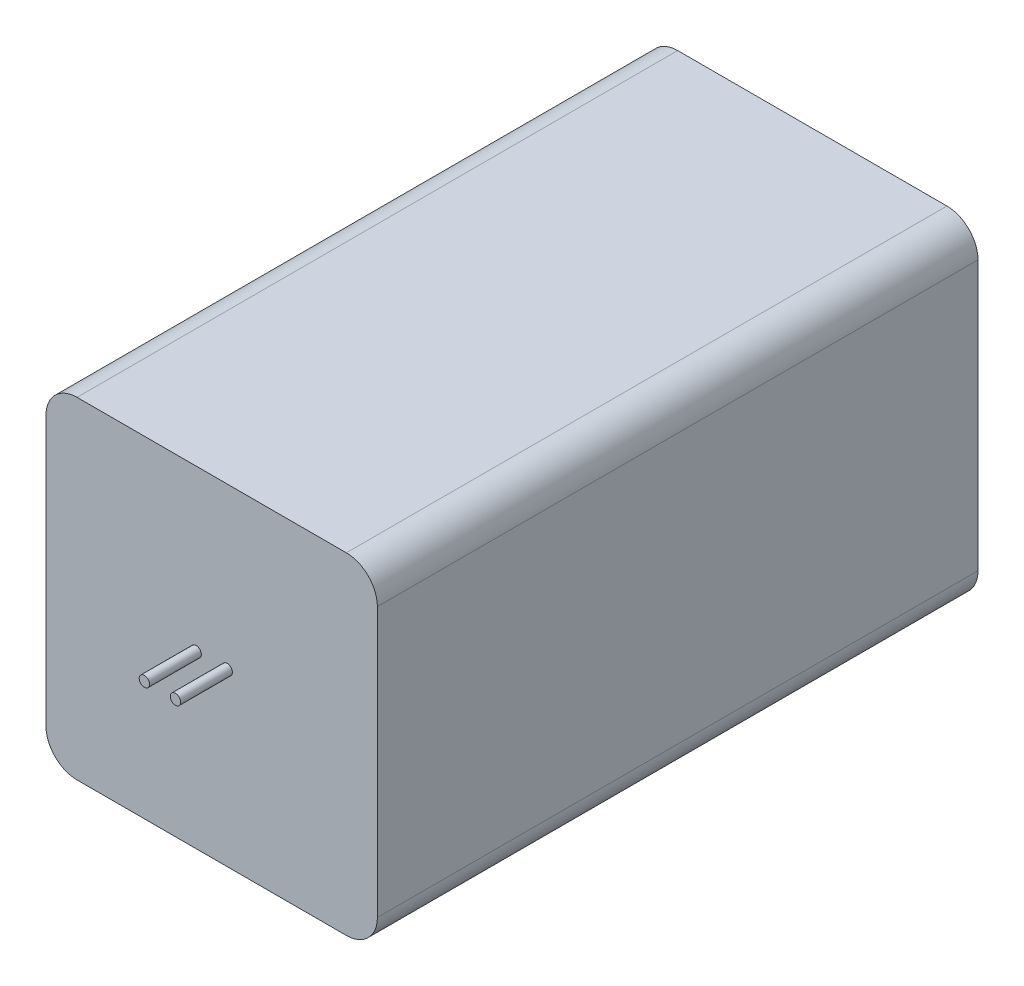
ISO-10303-21;
HEADER;
FILE_DESCRIPTION(('STEP AP214'),'2;1');
FILE_NAME('part.step','',(''),(''),'','','');
FILE_SCHEMA(('AUTOMOTIVE_DESIGN { 1 0 10303 214 1 1 1 1 }'));
ENDSEC;
DATA;
#1=APPLICATION_CONTEXT('core data for automotive mechanical design processes');
#2=APPLICATION_PROTOCOL_DEFINITION('international standard','automotive_design',2000,#1);
#3=PRODUCT_CONTEXT('',#1,'mechanical');
#4=PRODUCT('Part','Part','',(#3));
#5=PRODUCT_RELATED_PRODUCT_CATEGORY('part','',(#4));
#6=PRODUCT_DEFINITION_FORMATION('','',#4);
#7=PRODUCT_DEFINITION_CONTEXT('part definition',#1,'design');
#8=PRODUCT_DEFINITION('design','',#6,#7);
#9=PRODUCT_DEFINITION_SHAPE('','',#8);
#10=(LENGTH_UNIT() NAMED_UNIT(*) SI_UNIT(.MILLI.,.METRE.));
#11=(NAMED_UNIT(*) PLANE_ANGLE_UNIT() SI_UNIT($,.RADIAN.));
#12=(NAMED_UNIT(*) SI_UNIT($,.STERADIAN.) SOLID_ANGLE_UNIT());
#13=UNCERTAINTY_MEASURE_WITH_UNIT(LENGTH_MEASURE(1.E-05),#10,'distance_accuracy_value','');
#14=(GEOMETRIC_REPRESENTATION_CONTEXT(3) GLOBAL_UNCERTAINTY_ASSIGNED_CONTEXT((#13)) GLOBAL_UNIT_ASSIGNED_CONTEXT((#10,
#11,#12)) REPRESENTATION_CONTEXT('',''));
#15=CARTESIAN_POINT('',(0.,0.,0.));
#16=DIRECTION('',(0.,0.,1.));
#17=DIRECTION('',(1.,0.,0.));
#18=AXIS2_PLACEMENT_3D('',#15,#16,#17);
#19=CARTESIAN_POINT('',(1.5,0.5,63.));
#20=DIRECTION('',(0.,0.,-1.));
#21=DIRECTION('',(-1.,0.,0.));
#22=AXIS2_PLACEMENT_3D('',#19,#20,#21);
#23=CYLINDRICAL_SURFACE('',#22,0.500000000000001);
#24=CARTESIAN_POINT('',(1.5,0.5,63.));
#25=DIRECTION('',(0.,0.,1.));
#26=DIRECTION('',(1.,0.,0.));
#27=AXIS2_PLACEMENT_3D('',#24,#25,#26);
#28=CIRCLE('',#27,0.500000000000001);
#29=CARTESIAN_POINT('',(2.,0.5,63.));
#30=VERTEX_POINT('',#29);
#31=EDGE_CURVE('E58',#30,#30,#28,.T.);
#32=ORIENTED_EDGE('',*,*,#31,.F.);
#33=EDGE_LOOP('',(#32));
#34=FACE_BOUND('',#33,.T.);
#35=CARTESIAN_POINT('',(1.5,0.5,58.));
#36=DIRECTION('',(0.,0.,1.));
#37=DIRECTION('',(1.,0.,0.));
#38=AXIS2_PLACEMENT_3D('',#35,#36,#37);
#39=CIRCLE('',#38,0.500000000000001);
#40=CARTESIAN_POINT('',(2.,0.5,58.));
#41=VERTEX_POINT('',#40);
#42=EDGE_CURVE('E11',#41,#41,#39,.T.);
#43=ORIENTED_EDGE('',*,*,#42,.T.);
#44=EDGE_LOOP('',(#43));
#45=FACE_BOUND('',#44,.T.);
#46=ADVANCED_FACE('F54',(#34,#45),#23,.T.);
#47=CARTESIAN_POINT('',(1.5,0.5,63.));
#48=DIRECTION('',(0.,0.,1.));
#49=DIRECTION('',(1.,0.,0.));
#50=AXIS2_PLACEMENT_3D('',#47,#48,#49);
#51=PLANE('',#50);
#52=ORIENTED_EDGE('',*,*,#31,.T.);
#53=EDGE_LOOP('',(#52));
#54=FACE_BOUND('',#53,.T.);
#55=ADVANCED_FACE('F56',(#54),#51,.T.);
#56=CARTESIAN_POINT('',(1.5,0.5,58.));
#57=DIRECTION('',(0.,0.,1.));
#58=DIRECTION('',(1.,0.,0.));
#59=AXIS2_PLACEMENT_3D('',#56,#57,#58);
#60=PLANE('',#59);
#61=ORIENTED_EDGE('',*,*,#42,.F.);
#62=EDGE_LOOP('',(#61));
#63=FACE_BOUND('',#62,.T.);
#64=ADVANCED_FACE('F73',(#63),#60,.F.);
#65=CLOSED_SHELL('',(#46,#55,#64));
#66=MANIFOLD_SOLID_BREP('B2',#65);
#67=CARTESIAN_POINT('',(-1.5,0.5,63.));
#68=DIRECTION('',(0.,0.,-1.));
#69=DIRECTION('',(-1.,0.,0.));
#70=AXIS2_PLACEMENT_3D('',#67,#68,#69);
#71=CYLINDRICAL_SURFACE('',#70,0.500000000000001);
#72=CARTESIAN_POINT('',(-1.5,0.5,63.));
#73=DIRECTION('',(0.,0.,1.));
#74=DIRECTION('',(1.,0.,0.));
#75=AXIS2_PLACEMENT_3D('',#72,#73,#74);
#76=CIRCLE('',#75,0.500000000000001);
#77=CARTESIAN_POINT('',(-0.999999999999999,0.5,63.));
#78=VERTEX_POINT('',#77);
#79=EDGE_CURVE('E53',#78,#78,#76,.T.);
#80=ORIENTED_EDGE('',*,*,#79,.F.);
#81=EDGE_LOOP('',(#80));
#82=FACE_BOUND('',#81,.T.);
#83=CARTESIAN_POINT('',(-1.5,0.5,58.));
#84=DIRECTION('',(0.,0.,1.));
#85=DIRECTION('',(1.,0.,0.));
#86=AXIS2_PLACEMENT_3D('',#83,#84,#85);
#87=CIRCLE('',#86,0.500000000000001);
#88=CARTESIAN_POINT('',(-0.999999999999999,0.5,58.));
#89=VERTEX_POINT('',#88);
#90=EDGE_CURVE('E119',#89,#89,#87,.T.);
#91=ORIENTED_EDGE('',*,*,#90,.T.);
#92=EDGE_LOOP('',(#91));
#93=FACE_BOUND('',#92,.T.);
#94=ADVANCED_FACE('F116',(#82,#93),#71,.T.);
#95=CARTESIAN_POINT('',(-1.5,0.5,63.));
#96=DIRECTION('',(0.,0.,1.));
#97=DIRECTION('',(1.,0.,0.));
#98=AXIS2_PLACEMENT_3D('',#95,#96,#97);
#99=PLANE('',#98);
#100=ORIENTED_EDGE('',*,*,#79,.T.);
#101=EDGE_LOOP('',(#100));
#102=FACE_BOUND('',#101,.T.);
#103=ADVANCED_FACE('F131',(#102),#99,.T.);
#104=CARTESIAN_POINT('',(-1.5,0.5,58.));
#105=DIRECTION('',(0.,0.,1.));
#106=DIRECTION('',(1.,0.,0.));
#107=AXIS2_PLACEMENT_3D('',#104,#105,#106);
#108=PLANE('',#107);
#109=ORIENTED_EDGE('',*,*,#90,.F.);
#110=EDGE_LOOP('',(#109));
#111=FACE_BOUND('',#110,.T.);
#112=ADVANCED_FACE('F129',(#111),#108,.F.);
#113=CLOSED_SHELL('',(#94,#103,#112));
#114=MANIFOLD_SOLID_BREP('B6',#113);
#115=CARTESIAN_POINT('',(-16.,16.,58.));
#116=DIRECTION('',(1.,0.,0.));
#117=DIRECTION('',(0.,1.,0.));
#118=AXIS2_PLACEMENT_3D('',#115,#116,#117);
#119=PLANE('',#118);
#120=DIRECTION('',(0.,-1.,0.));
#121=VECTOR('',#120,1.);
#122=CARTESIAN_POINT('',(-16.,16.,0.));
#123=LINE('',#122,#121);
#124=CARTESIAN_POINT('',(-16.,13.,0.));
#125=VERTEX_POINT('',#124);
#126=CARTESIAN_POINT('',(-16.,-13.,0.));
#127=VERTEX_POINT('',#126);
#128=EDGE_CURVE('E270',#125,#127,#123,.T.);
#129=ORIENTED_EDGE('',*,*,#128,.T.);
#130=DIRECTION('',(0.,0.,-1.));
#131=VECTOR('',#130,1.);
#132=CARTESIAN_POINT('',(-16.,-13.,58.));
#133=LINE('',#132,#131);
#134=CARTESIAN_POINT('',(-16.,-13.,58.));
#135=VERTEX_POINT('',#134);
#136=EDGE_CURVE('E304',#127,#135,#133,.F.);
#137=ORIENTED_EDGE('',*,*,#136,.T.);
#138=DIRECTION('',(0.,-1.,0.));
#139=VECTOR('',#138,1.);
#140=CARTESIAN_POINT('',(-16.,16.,58.));
#141=LINE('',#140,#139);
#142=CARTESIAN_POINT('',(-16.,13.,58.));
#143=VERTEX_POINT('',#142);
#144=EDGE_CURVE('E268',#143,#135,#141,.T.);
#145=ORIENTED_EDGE('',*,*,#144,.F.);
#146=DIRECTION('',(0.,0.,-1.));
#147=VECTOR('',#146,1.);
#148=CARTESIAN_POINT('',(-16.,13.,58.));
#149=LINE('',#148,#147);
#150=EDGE_CURVE('E300',#143,#125,#149,.T.);
#151=ORIENTED_EDGE('',*,*,#150,.T.);
#152=EDGE_LOOP('',(#129,#137,#145,#151));
#153=FACE_BOUND('',#152,.T.);
#154=ADVANCED_FACE('F169',(#153),#119,.F.);
#155=CARTESIAN_POINT('',(16.,-16.,58.));
#156=DIRECTION('',(0.,1.,0.));
#157=DIRECTION('',(-1.,0.,0.));
#158=AXIS2_PLACEMENT_3D('',#155,#156,#157);
#159=PLANE('',#158);
#160=DIRECTION('',(1.,0.,0.));
#161=VECTOR('',#160,1.);
#162=CARTESIAN_POINT('',(16.,-16.,0.));
#163=LINE('',#162,#161);
#164=CARTESIAN_POINT('',(-13.,-16.,0.));
#165=VERTEX_POINT('',#164);
#166=CARTESIAN_POINT('',(13.,-16.,0.));
#167=VERTEX_POINT('',#166);
#168=EDGE_CURVE('E264',#165,#167,#163,.T.);
#169=ORIENTED_EDGE('',*,*,#168,.T.);
#170=DIRECTION('',(0.,0.,-1.));
#171=VECTOR('',#170,1.);
#172=CARTESIAN_POINT('',(13.,-16.,58.));
#173=LINE('',#172,#171);
#174=CARTESIAN_POINT('',(13.,-16.,58.));
#175=VERTEX_POINT('',#174);
#176=EDGE_CURVE('E240',#167,#175,#173,.F.);
#177=ORIENTED_EDGE('',*,*,#176,.T.);
#178=DIRECTION('',(1.,0.,0.));
#179=VECTOR('',#178,1.);
#180=CARTESIAN_POINT('',(16.,-16.,58.));
#181=LINE('',#180,#179);
#182=CARTESIAN_POINT('',(-13.,-16.,58.));
#183=VERTEX_POINT('',#182);
#184=EDGE_CURVE('E323',#183,#175,#181,.T.);
#185=ORIENTED_EDGE('',*,*,#184,.F.);
#186=DIRECTION('',(0.,0.,-1.));
#187=VECTOR('',#186,1.);
#188=CARTESIAN_POINT('',(-13.,-16.,58.));
#189=LINE('',#188,#187);
#190=EDGE_CURVE('E246',#183,#165,#189,.T.);
#191=ORIENTED_EDGE('',*,*,#190,.T.);
#192=EDGE_LOOP('',(#169,#177,#185,#191));
#193=FACE_BOUND('',#192,.T.);
#194=ADVANCED_FACE('F344',(#193),#159,.F.);
#195=CARTESIAN_POINT('',(16.,16.,58.));
#196=DIRECTION('',(-1.,0.,0.));
#197=DIRECTION('',(0.,-1.,0.));
#198=AXIS2_PLACEMENT_3D('',#195,#196,#197);
#199=PLANE('',#198);
#200=DIRECTION('',(0.,1.,0.));
#201=VECTOR('',#200,1.);
#202=CARTESIAN_POINT('',(16.,16.,58.));
#203=LINE('',#202,#201);
#204=CARTESIAN_POINT('',(16.,-13.,58.));
#205=VERTEX_POINT('',#204);
#206=CARTESIAN_POINT('',(16.,13.,58.));
#207=VERTEX_POINT('',#206);
#208=EDGE_CURVE('E255',#205,#207,#203,.T.);
#209=ORIENTED_EDGE('',*,*,#208,.F.);
#210=DIRECTION('',(0.,0.,-1.));
#211=VECTOR('',#210,1.);
#212=CARTESIAN_POINT('',(16.,-13.,58.));
#213=LINE('',#212,#211);
#214=CARTESIAN_POINT('',(16.,-13.,0.));
#215=VERTEX_POINT('',#214);
#216=EDGE_CURVE('E239',#205,#215,#213,.T.);
#217=ORIENTED_EDGE('',*,*,#216,.T.);
#218=DIRECTION('',(0.,1.,0.));
#219=VECTOR('',#218,1.);
#220=CARTESIAN_POINT('',(16.,16.,0.));
#221=LINE('',#220,#219);
#222=CARTESIAN_POINT('',(16.,13.,0.));
#223=VERTEX_POINT('',#222);
#224=EDGE_CURVE('E253',#215,#223,#221,.T.);
#225=ORIENTED_EDGE('',*,*,#224,.T.);
#226=DIRECTION('',(0.,0.,-1.));
#227=VECTOR('',#226,1.);
#228=CARTESIAN_POINT('',(16.,13.,58.));
#229=LINE('',#228,#227);
#230=EDGE_CURVE('E258',#223,#207,#229,.F.);
#231=ORIENTED_EDGE('',*,*,#230,.T.);
#232=EDGE_LOOP('',(#209,#217,#225,#231));
#233=FACE_BOUND('',#232,.T.);
#234=ADVANCED_FACE('F252',(#233),#199,.F.);
#235=CARTESIAN_POINT('',(16.,16.,58.));
#236=DIRECTION('',(0.,-1.,0.));
#237=DIRECTION('',(1.,0.,0.));
#238=AXIS2_PLACEMENT_3D('',#235,#236,#237);
#239=PLANE('',#238);
#240=DIRECTION('',(-1.,0.,0.));
#241=VECTOR('',#240,1.);
#242=CARTESIAN_POINT('',(16.,16.,0.));
#243=LINE('',#242,#241);
#244=CARTESIAN_POINT('',(13.,16.,0.));
#245=VERTEX_POINT('',#244);
#246=CARTESIAN_POINT('',(-13.,16.,0.));
#247=VERTEX_POINT('',#246);
#248=EDGE_CURVE('E263',#245,#247,#243,.T.);
#249=ORIENTED_EDGE('',*,*,#248,.T.);
#250=DIRECTION('',(0.,0.,-1.));
#251=VECTOR('',#250,1.);
#252=CARTESIAN_POINT('',(-13.,16.,58.));
#253=LINE('',#252,#251);
#254=CARTESIAN_POINT('',(-13.,16.,58.));
#255=VERTEX_POINT('',#254);
#256=EDGE_CURVE('E114',#247,#255,#253,.F.);
#257=ORIENTED_EDGE('',*,*,#256,.T.);
#258=DIRECTION('',(-1.,0.,0.));
#259=VECTOR('',#258,1.);
#260=CARTESIAN_POINT('',(16.,16.,58.));
#261=LINE('',#260,#259);
#262=CARTESIAN_POINT('',(13.,16.,58.));
#263=VERTEX_POINT('',#262);
#264=EDGE_CURVE('E275',#263,#255,#261,.T.);
#265=ORIENTED_EDGE('',*,*,#264,.F.);
#266=DIRECTION('',(0.,0.,-1.));
#267=VECTOR('',#266,1.);
#268=CARTESIAN_POINT('',(13.,16.,58.));
#269=LINE('',#268,#267);
#270=EDGE_CURVE('E178',#263,#245,#269,.T.);
#271=ORIENTED_EDGE('',*,*,#270,.T.);
#272=EDGE_LOOP('',(#249,#257,#265,#271));
#273=FACE_BOUND('',#272,.T.);
#274=ADVANCED_FACE('F309',(#273),#239,.F.);
#275=CARTESIAN_POINT('',(0.,0.,58.));
#276=DIRECTION('',(0.,0.,-1.));
#277=DIRECTION('',(-1.,0.,0.));
#278=AXIS2_PLACEMENT_3D('',#275,#276,#277);
#279=PLANE('',#278);
#280=ORIENTED_EDGE('',*,*,#184,.T.);
#281=CARTESIAN_POINT('',(13.,-13.,58.));
#282=DIRECTION('',(0.,0.,-1.));
#283=DIRECTION('',(-1.,0.,0.));
#284=AXIS2_PLACEMENT_3D('',#281,#282,#283);
#285=CIRCLE('',#284,3.);
#286=EDGE_CURVE('E297',#175,#205,#285,.F.);
#287=ORIENTED_EDGE('',*,*,#286,.T.);
#288=ORIENTED_EDGE('',*,*,#208,.T.);
#289=CARTESIAN_POINT('',(13.,13.,58.));
#290=DIRECTION('',(0.,0.,-1.));
#291=DIRECTION('',(-1.,0.,0.));
#292=AXIS2_PLACEMENT_3D('',#289,#290,#291);
#293=CIRCLE('',#292,3.);
#294=EDGE_CURVE('E190',#207,#263,#293,.F.);
#295=ORIENTED_EDGE('',*,*,#294,.T.);
#296=ORIENTED_EDGE('',*,*,#264,.T.);
#297=CARTESIAN_POINT('',(-13.,13.,58.));
#298=DIRECTION('',(0.,0.,-1.));
#299=DIRECTION('',(-1.,0.,0.));
#300=AXIS2_PLACEMENT_3D('',#297,#298,#299);
#301=CIRCLE('',#300,3.);
#302=EDGE_CURVE('E291',#255,#143,#301,.F.);
#303=ORIENTED_EDGE('',*,*,#302,.T.);
#304=ORIENTED_EDGE('',*,*,#144,.T.);
#305=CARTESIAN_POINT('',(-13.,-13.,58.));
#306=DIRECTION('',(0.,0.,-1.));
#307=DIRECTION('',(-1.,0.,0.));
#308=AXIS2_PLACEMENT_3D('',#305,#306,#307);
#309=CIRCLE('',#308,3.);
#310=EDGE_CURVE('E294',#135,#183,#309,.F.);
#311=ORIENTED_EDGE('',*,*,#310,.T.);
#312=EDGE_LOOP('',(#280,#287,#288,#295,#296,#303,#304,#311));
#313=FACE_BOUND('',#312,.T.);
#314=ADVANCED_FACE('F333',(#313),#279,.F.);
#315=CARTESIAN_POINT('',(0.,0.,0.));
#316=DIRECTION('',(0.,0.,-1.));
#317=DIRECTION('',(-1.,0.,0.));
#318=AXIS2_PLACEMENT_3D('',#315,#316,#317);
#319=PLANE('',#318);
#320=ORIENTED_EDGE('',*,*,#224,.F.);
#321=CARTESIAN_POINT('',(13.,-13.,0.));
#322=DIRECTION('',(0.,0.,-1.));
#323=DIRECTION('',(-1.,0.,0.));
#324=AXIS2_PLACEMENT_3D('',#321,#322,#323);
#325=CIRCLE('',#324,3.);
#326=EDGE_CURVE('E235',#215,#167,#325,.T.);
#327=ORIENTED_EDGE('',*,*,#326,.T.);
#328=ORIENTED_EDGE('',*,*,#168,.F.);
#329=CARTESIAN_POINT('',(-13.,-13.,0.));
#330=DIRECTION('',(0.,0.,-1.));
#331=DIRECTION('',(-1.,0.,0.));
#332=AXIS2_PLACEMENT_3D('',#329,#330,#331);
#333=CIRCLE('',#332,3.);
#334=EDGE_CURVE('E247',#165,#127,#333,.T.);
#335=ORIENTED_EDGE('',*,*,#334,.T.);
#336=ORIENTED_EDGE('',*,*,#128,.F.);
#337=CARTESIAN_POINT('',(-13.,13.,0.));
#338=DIRECTION('',(0.,0.,-1.));
#339=DIRECTION('',(-1.,0.,0.));
#340=AXIS2_PLACEMENT_3D('',#337,#338,#339);
#341=CIRCLE('',#340,3.);
#342=EDGE_CURVE('E279',#125,#247,#341,.T.);
#343=ORIENTED_EDGE('',*,*,#342,.T.);
#344=ORIENTED_EDGE('',*,*,#248,.F.);
#345=CARTESIAN_POINT('',(13.,13.,0.));
#346=DIRECTION('',(0.,0.,-1.));
#347=DIRECTION('',(-1.,0.,0.));
#348=AXIS2_PLACEMENT_3D('',#345,#346,#347);
#349=CIRCLE('',#348,3.);
#350=EDGE_CURVE('E257',#245,#223,#349,.T.);
#351=ORIENTED_EDGE('',*,*,#350,.T.);
#352=EDGE_LOOP('',(#320,#327,#328,#335,#336,#343,#344,#351));
#353=FACE_BOUND('',#352,.T.);
#354=ADVANCED_FACE('F260',(#353),#319,.T.);
#355=CARTESIAN_POINT('',(13.,-13.,58.));
#356=DIRECTION('',(0.,0.,-1.));
#357=DIRECTION('',(-1.,0.,0.));
#358=AXIS2_PLACEMENT_3D('',#355,#356,#357);
#359=CYLINDRICAL_SURFACE('',#358,3.);
#360=ORIENTED_EDGE('',*,*,#286,.F.);
#361=ORIENTED_EDGE('',*,*,#176,.F.);
#362=ORIENTED_EDGE('',*,*,#326,.F.);
#363=ORIENTED_EDGE('',*,*,#216,.F.);
#364=EDGE_LOOP('',(#360,#361,#362,#363));
#365=FACE_BOUND('',#364,.T.);
#366=ADVANCED_FACE('F238',(#365),#359,.T.);
#367=CARTESIAN_POINT('',(-13.,-13.,58.));
#368=DIRECTION('',(0.,0.,-1.));
#369=DIRECTION('',(-1.,0.,0.));
#370=AXIS2_PLACEMENT_3D('',#367,#368,#369);
#371=CYLINDRICAL_SURFACE('',#370,3.);
#372=ORIENTED_EDGE('',*,*,#310,.F.);
#373=ORIENTED_EDGE('',*,*,#136,.F.);
#374=ORIENTED_EDGE('',*,*,#334,.F.);
#375=ORIENTED_EDGE('',*,*,#190,.F.);
#376=EDGE_LOOP('',(#372,#373,#374,#375));
#377=FACE_BOUND('',#376,.T.);
#378=ADVANCED_FACE('F355',(#377),#371,.T.);
#379=CARTESIAN_POINT('',(-13.,13.,58.));
#380=DIRECTION('',(0.,0.,-1.));
#381=DIRECTION('',(-1.,0.,0.));
#382=AXIS2_PLACEMENT_3D('',#379,#380,#381);
#383=CYLINDRICAL_SURFACE('',#382,3.);
#384=ORIENTED_EDGE('',*,*,#302,.F.);
#385=ORIENTED_EDGE('',*,*,#256,.F.);
#386=ORIENTED_EDGE('',*,*,#342,.F.);
#387=ORIENTED_EDGE('',*,*,#150,.F.);
#388=EDGE_LOOP('',(#384,#385,#386,#387));
#389=FACE_BOUND('',#388,.T.);
#390=ADVANCED_FACE('F316',(#389),#383,.T.);
#391=CARTESIAN_POINT('',(13.,13.,58.));
#392=DIRECTION('',(0.,0.,-1.));
#393=DIRECTION('',(-1.,0.,0.));
#394=AXIS2_PLACEMENT_3D('',#391,#392,#393);
#395=CYLINDRICAL_SURFACE('',#394,3.);
#396=ORIENTED_EDGE('',*,*,#294,.F.);
#397=ORIENTED_EDGE('',*,*,#230,.F.);
#398=ORIENTED_EDGE('',*,*,#350,.F.);
#399=ORIENTED_EDGE('',*,*,#270,.F.);
#400=EDGE_LOOP('',(#396,#397,#398,#399));
#401=FACE_BOUND('',#400,.T.);
#402=ADVANCED_FACE('F171',(#401),#395,.T.);
#403=CLOSED_SHELL('',(#154,#194,#234,#274,#314,#354,#366,#378,#390,#402));
#404=MANIFOLD_SOLID_BREP('B48',#403);
#405=ADVANCED_BREP_SHAPE_REPRESENTATION('',(#18,#66,#114,#404),#14);
#406=SHAPE_DEFINITION_REPRESENTATION(#9,#405);
ENDSEC;
END-ISO-10303-21;
